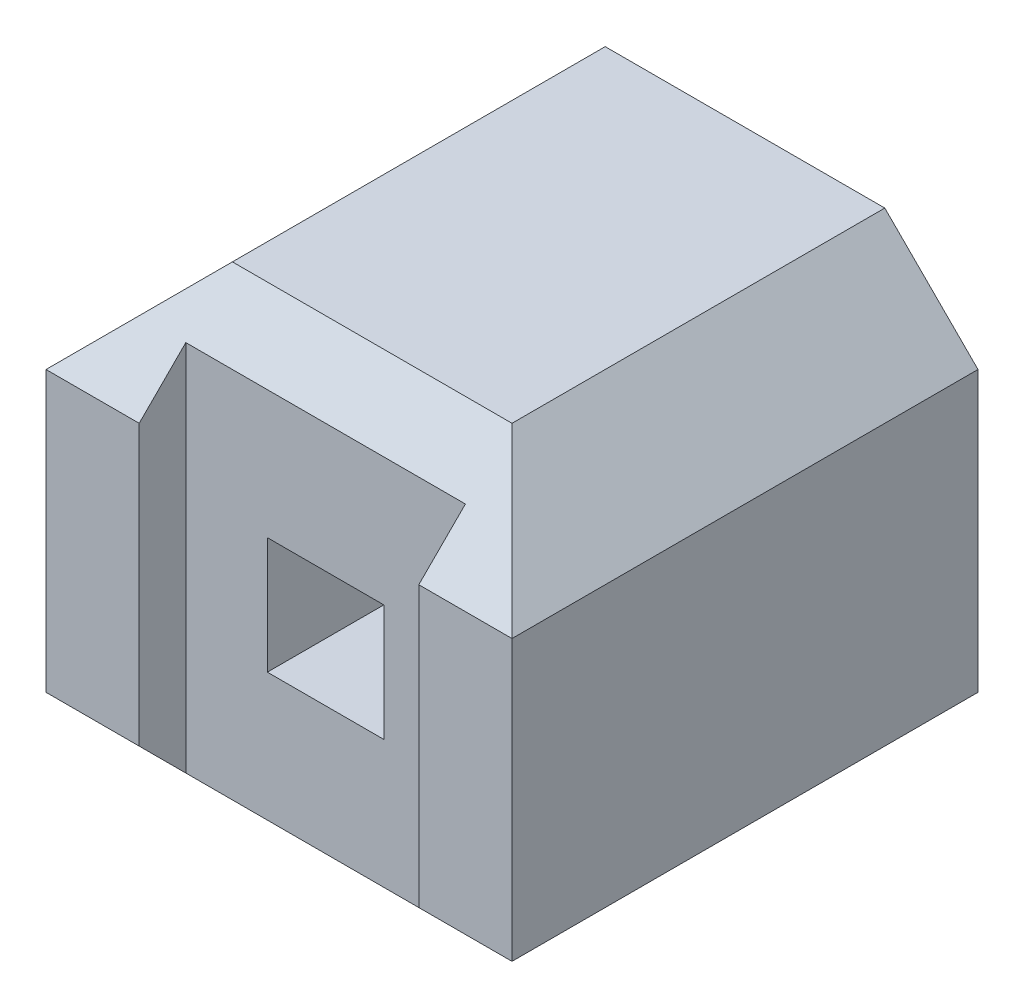
ISO-10303-21;
HEADER;
FILE_DESCRIPTION(('STEP AP214'),'2;1');
FILE_NAME('part.step','',(''),(''),'','','');
FILE_SCHEMA(('AUTOMOTIVE_DESIGN { 1 0 10303 214 1 1 1 1 }'));
ENDSEC;
DATA;
#1=APPLICATION_CONTEXT('core data for automotive mechanical design processes');
#2=APPLICATION_PROTOCOL_DEFINITION('international standard','automotive_design',2000,#1);
#3=PRODUCT_CONTEXT('',#1,'mechanical');
#4=PRODUCT('Part','Part','',(#3));
#5=PRODUCT_RELATED_PRODUCT_CATEGORY('part','',(#4));
#6=PRODUCT_DEFINITION_FORMATION('','',#4);
#7=PRODUCT_DEFINITION_CONTEXT('part definition',#1,'design');
#8=PRODUCT_DEFINITION('design','',#6,#7);
#9=PRODUCT_DEFINITION_SHAPE('','',#8);
#10=(LENGTH_UNIT() NAMED_UNIT(*) SI_UNIT(.MILLI.,.METRE.));
#11=(NAMED_UNIT(*) PLANE_ANGLE_UNIT() SI_UNIT($,.RADIAN.));
#12=(NAMED_UNIT(*) SI_UNIT($,.STERADIAN.) SOLID_ANGLE_UNIT());
#13=UNCERTAINTY_MEASURE_WITH_UNIT(LENGTH_MEASURE(1.E-05),#10,'distance_accuracy_value','');
#14=(GEOMETRIC_REPRESENTATION_CONTEXT(3) GLOBAL_UNCERTAINTY_ASSIGNED_CONTEXT((#13)) GLOBAL_UNIT_ASSIGNED_CONTEXT((#10,
#11,#12)) REPRESENTATION_CONTEXT('',''));
#15=CARTESIAN_POINT('',(0.,0.,0.));
#16=DIRECTION('',(0.,0.,1.));
#17=DIRECTION('',(1.,0.,0.));
#18=AXIS2_PLACEMENT_3D('',#15,#16,#17);
#19=CARTESIAN_POINT('',(1.27,1.27,2.54));
#20=DIRECTION('',(-1.,0.,0.));
#21=DIRECTION('',(0.,0.,1.));
#22=AXIS2_PLACEMENT_3D('',#19,#20,#21);
#23=PLANE('',#22);
#24=DIRECTION('',(0.,0.,1.));
#25=VECTOR('',#24,1.);
#26=CARTESIAN_POINT('',(1.27,3.302,2.54));
#27=LINE('',#26,#25);
#28=CARTESIAN_POINT('',(1.27,3.302,0.));
#29=VERTEX_POINT('',#28);
#30=CARTESIAN_POINT('',(1.27,3.302,2.54));
#31=VERTEX_POINT('',#30);
#32=EDGE_CURVE('E158',#29,#31,#27,.T.);
#33=ORIENTED_EDGE('',*,*,#32,.T.);
#34=DIRECTION('',(0.,1.,0.));
#35=VECTOR('',#34,1.);
#36=CARTESIAN_POINT('',(1.27,0.,2.54));
#37=LINE('',#36,#35);
#38=CARTESIAN_POINT('',(1.27,1.778,2.54));
#39=VERTEX_POINT('',#38);
#40=EDGE_CURVE('E127',#39,#31,#37,.T.);
#41=ORIENTED_EDGE('',*,*,#40,.F.);
#42=DIRECTION('',(0.,0.,1.));
#43=VECTOR('',#42,1.);
#44=CARTESIAN_POINT('',(1.27,1.778,2.54));
#45=LINE('',#44,#43);
#46=CARTESIAN_POINT('',(1.27,1.778,0.));
#47=VERTEX_POINT('',#46);
#48=EDGE_CURVE('E151',#39,#47,#45,.F.);
#49=ORIENTED_EDGE('',*,*,#48,.T.);
#50=DIRECTION('',(0.,1.,0.));
#51=VECTOR('',#50,1.);
#52=CARTESIAN_POINT('',(1.27,1.27,0.));
#53=LINE('',#52,#51);
#54=EDGE_CURVE('E19',#29,#47,#53,.F.);
#55=ORIENTED_EDGE('',*,*,#54,.F.);
#56=EDGE_LOOP('',(#33,#41,#49,#55));
#57=FACE_BOUND('',#56,.T.);
#58=ADVANCED_FACE('F16',(#57),#23,.F.);
#59=CARTESIAN_POINT('',(0.,0.,2.54));
#60=DIRECTION('',(0.,0.,1.));
#61=DIRECTION('',(1.,0.,0.));
#62=AXIS2_PLACEMENT_3D('',#59,#60,#61);
#63=PLANE('',#62);
#64=ORIENTED_EDGE('',*,*,#40,.T.);
#65=DIRECTION('',(1.,0.,0.));
#66=VECTOR('',#65,1.);
#67=CARTESIAN_POINT('',(0.,3.302,2.54));
#68=LINE('',#67,#66);
#69=CARTESIAN_POINT('',(0.762,3.302,2.54));
#70=VERTEX_POINT('',#69);
#71=EDGE_CURVE('E155',#31,#70,#68,.F.);
#72=ORIENTED_EDGE('',*,*,#71,.T.);
#73=DIRECTION('',(0.,-1.,0.));
#74=VECTOR('',#73,1.);
#75=CARTESIAN_POINT('',(0.762,3.81,2.54));
#76=LINE('',#75,#74);
#77=CARTESIAN_POINT('',(0.762,1.778,2.54));
#78=VERTEX_POINT('',#77);
#79=EDGE_CURVE('E134',#78,#70,#76,.F.);
#80=ORIENTED_EDGE('',*,*,#79,.F.);
#81=DIRECTION('',(1.,0.,0.));
#82=VECTOR('',#81,1.);
#83=CARTESIAN_POINT('',(0.,1.778,2.54));
#84=LINE('',#83,#82);
#85=EDGE_CURVE('E130',#78,#39,#84,.T.);
#86=ORIENTED_EDGE('',*,*,#85,.T.);
#87=EDGE_LOOP('',(#64,#72,#80,#86));
#88=FACE_BOUND('',#87,.T.);
#89=ADVANCED_FACE('F132',(#88),#63,.T.);
#90=CARTESIAN_POINT('',(1.27,1.778,2.54));
#91=DIRECTION('',(-0.707106781186548,0.707106781186547,0.));
#92=DIRECTION('',(-0.707106781186547,-0.707106781186548,0.));
#93=AXIS2_PLACEMENT_3D('',#90,#91,#92);
#94=PLANE('',#93);
#95=ORIENTED_EDGE('',*,*,#48,.F.);
#96=DIRECTION('',(0.577350269189626,0.577350269189625,0.577350269189626));
#97=VECTOR('',#96,1.);
#98=CARTESIAN_POINT('',(0.762,1.27,2.032));
#99=LINE('',#98,#97);
#100=CARTESIAN_POINT('',(0.762,1.27,2.032));
#101=VERTEX_POINT('',#100);
#102=EDGE_CURVE('E138',#101,#39,#99,.T.);
#103=ORIENTED_EDGE('',*,*,#102,.F.);
#104=DIRECTION('',(0.,0.,1.));
#105=VECTOR('',#104,1.);
#106=CARTESIAN_POINT('',(0.762,1.27,2.54));
#107=LINE('',#106,#105);
#108=CARTESIAN_POINT('',(0.762,1.27,0.));
#109=VERTEX_POINT('',#108);
#110=EDGE_CURVE('E182',#101,#109,#107,.F.);
#111=ORIENTED_EDGE('',*,*,#110,.T.);
#112=DIRECTION('',(-0.707106781186547,-0.707106781186548,0.));
#113=VECTOR('',#112,1.);
#114=CARTESIAN_POINT('',(1.27,1.778,0.));
#115=LINE('',#114,#113);
#116=EDGE_CURVE('E153',#47,#109,#115,.T.);
#117=ORIENTED_EDGE('',*,*,#116,.F.);
#118=EDGE_LOOP('',(#95,#103,#111,#117));
#119=FACE_BOUND('',#118,.T.);
#120=ADVANCED_FACE('F152',(#119),#94,.F.);
#121=CARTESIAN_POINT('',(0.762,3.81,2.54));
#122=DIRECTION('',(-0.707106781186547,-0.707106781186548,0.));
#123=DIRECTION('',(0.707106781186548,-0.707106781186547,0.));
#124=AXIS2_PLACEMENT_3D('',#121,#122,#123);
#125=PLANE('',#124);
#126=DIRECTION('',(0.,0.,-1.));
#127=VECTOR('',#126,1.);
#128=CARTESIAN_POINT('',(0.762,3.81,2.54));
#129=LINE('',#128,#127);
#130=CARTESIAN_POINT('',(0.762,3.81,0.));
#131=VERTEX_POINT('',#130);
#132=CARTESIAN_POINT('',(0.762,3.81,2.032));
#133=VERTEX_POINT('',#132);
#134=EDGE_CURVE('E186',#131,#133,#129,.F.);
#135=ORIENTED_EDGE('',*,*,#134,.T.);
#136=DIRECTION('',(-0.577350269189626,0.577350269189626,-0.577350269189626));
#137=VECTOR('',#136,1.);
#138=CARTESIAN_POINT('',(1.27,3.302,2.54));
#139=LINE('',#138,#137);
#140=EDGE_CURVE('E165',#31,#133,#139,.T.);
#141=ORIENTED_EDGE('',*,*,#140,.F.);
#142=ORIENTED_EDGE('',*,*,#32,.F.);
#143=DIRECTION('',(0.707106781186548,-0.707106781186547,0.));
#144=VECTOR('',#143,1.);
#145=CARTESIAN_POINT('',(0.762,3.81,0.));
#146=LINE('',#145,#144);
#147=EDGE_CURVE('E167',#131,#29,#146,.T.);
#148=ORIENTED_EDGE('',*,*,#147,.F.);
#149=EDGE_LOOP('',(#135,#141,#142,#148));
#150=FACE_BOUND('',#149,.T.);
#151=ADVANCED_FACE('F357',(#150),#125,.F.);
#152=CARTESIAN_POINT('',(0.762,3.81,2.286));
#153=DIRECTION('',(-1.,0.,0.));
#154=DIRECTION('',(0.,-1.,0.));
#155=AXIS2_PLACEMENT_3D('',#152,#153,#154);
#156=PLANE('',#155);
#157=ORIENTED_EDGE('',*,*,#79,.T.);
#158=DIRECTION('',(0.,-0.707106781186547,0.707106781186548));
#159=VECTOR('',#158,1.);
#160=CARTESIAN_POINT('',(0.762,3.302,2.54));
#161=LINE('',#160,#159);
#162=CARTESIAN_POINT('',(0.762,3.556,2.286));
#163=VERTEX_POINT('',#162);
#164=EDGE_CURVE('E196',#163,#70,#161,.T.);
#165=ORIENTED_EDGE('',*,*,#164,.F.);
#166=DIRECTION('',(0.,1.,0.));
#167=VECTOR('',#166,1.);
#168=CARTESIAN_POINT('',(0.762,0.,2.286));
#169=LINE('',#168,#167);
#170=CARTESIAN_POINT('',(0.762,1.524,2.286));
#171=VERTEX_POINT('',#170);
#172=EDGE_CURVE('E211',#163,#171,#169,.F.);
#173=ORIENTED_EDGE('',*,*,#172,.T.);
#174=DIRECTION('',(0.,-0.707106781186547,-0.707106781186548));
#175=VECTOR('',#174,1.);
#176=CARTESIAN_POINT('',(0.762,1.778,2.54));
#177=LINE('',#176,#175);
#178=EDGE_CURVE('E146',#78,#171,#177,.T.);
#179=ORIENTED_EDGE('',*,*,#178,.F.);
#180=EDGE_LOOP('',(#157,#165,#173,#179));
#181=FACE_BOUND('',#180,.T.);
#182=ADVANCED_FACE('F292',(#181),#156,.T.);
#183=CARTESIAN_POINT('',(-0.762,1.27,2.286));
#184=DIRECTION('',(1.,0.,0.));
#185=DIRECTION('',(0.,0.,-1.));
#186=AXIS2_PLACEMENT_3D('',#183,#184,#185);
#187=PLANE('',#186);
#188=DIRECTION('',(0.,1.,0.));
#189=VECTOR('',#188,1.);
#190=CARTESIAN_POINT('',(-0.762,0.,2.286));
#191=LINE('',#190,#189);
#192=CARTESIAN_POINT('',(-0.762,1.524,2.286));
#193=VERTEX_POINT('',#192);
#194=CARTESIAN_POINT('',(-0.762,3.556,2.286));
#195=VERTEX_POINT('',#194);
#196=EDGE_CURVE('E217',#193,#195,#191,.T.);
#197=ORIENTED_EDGE('',*,*,#196,.T.);
#198=DIRECTION('',(0.,-0.707106781186547,0.707106781186548));
#199=VECTOR('',#198,1.);
#200=CARTESIAN_POINT('',(-0.762,3.302,2.54));
#201=LINE('',#200,#199);
#202=CARTESIAN_POINT('',(-0.762,3.302,2.54));
#203=VERTEX_POINT('',#202);
#204=EDGE_CURVE('E194',#203,#195,#201,.F.);
#205=ORIENTED_EDGE('',*,*,#204,.F.);
#206=DIRECTION('',(0.,1.,0.));
#207=VECTOR('',#206,1.);
#208=CARTESIAN_POINT('',(-0.762,1.27,2.54));
#209=LINE('',#208,#207);
#210=CARTESIAN_POINT('',(-0.762,1.778,2.54));
#211=VERTEX_POINT('',#210);
#212=EDGE_CURVE('E171',#203,#211,#209,.F.);
#213=ORIENTED_EDGE('',*,*,#212,.T.);
#214=DIRECTION('',(0.,-0.707106781186547,-0.707106781186548));
#215=VECTOR('',#214,1.);
#216=CARTESIAN_POINT('',(-0.762,1.778,2.54));
#217=LINE('',#216,#215);
#218=EDGE_CURVE('E176',#193,#211,#217,.F.);
#219=ORIENTED_EDGE('',*,*,#218,.F.);
#220=EDGE_LOOP('',(#197,#205,#213,#219));
#221=FACE_BOUND('',#220,.T.);
#222=ADVANCED_FACE('F283',(#221),#187,.T.);
#223=CARTESIAN_POINT('',(0.3175,2.2225,2.794));
#224=DIRECTION('',(0.,-1.,0.));
#225=DIRECTION('',(0.,0.,-1.));
#226=AXIS2_PLACEMENT_3D('',#223,#224,#225);
#227=PLANE('',#226);
#228=DIRECTION('',(-1.,0.,0.));
#229=VECTOR('',#228,1.);
#230=CARTESIAN_POINT('',(0.,2.2225,2.286));
#231=LINE('',#230,#229);
#232=CARTESIAN_POINT('',(-0.3175,2.2225,2.286));
#233=VERTEX_POINT('',#232);
#234=CARTESIAN_POINT('',(0.3175,2.2225,2.286));
#235=VERTEX_POINT('',#234);
#236=EDGE_CURVE('E209',#233,#235,#231,.F.);
#237=ORIENTED_EDGE('',*,*,#236,.T.);
#238=DIRECTION('',(0.,0.,-1.));
#239=VECTOR('',#238,1.);
#240=CARTESIAN_POINT('',(0.3175,2.2225,2.794));
#241=LINE('',#240,#239);
#242=CARTESIAN_POINT('',(0.3175,2.2225,0.));
#243=VERTEX_POINT('',#242);
#244=EDGE_CURVE('E228',#235,#243,#241,.T.);
#245=ORIENTED_EDGE('',*,*,#244,.T.);
#246=DIRECTION('',(1.,0.,0.));
#247=VECTOR('',#246,1.);
#248=CARTESIAN_POINT('',(0.3175,2.2225,0.));
#249=LINE('',#248,#247);
#250=CARTESIAN_POINT('',(-0.3175,2.2225,0.));
#251=VERTEX_POINT('',#250);
#252=EDGE_CURVE('E173',#251,#243,#249,.T.);
#253=ORIENTED_EDGE('',*,*,#252,.F.);
#254=DIRECTION('',(0.,0.,1.));
#255=VECTOR('',#254,1.);
#256=CARTESIAN_POINT('',(-0.3175,2.2225,2.794));
#257=LINE('',#256,#255);
#258=EDGE_CURVE('E204',#251,#233,#257,.T.);
#259=ORIENTED_EDGE('',*,*,#258,.T.);
#260=EDGE_LOOP('',(#237,#245,#253,#259));
#261=FACE_BOUND('',#260,.T.);
#262=ADVANCED_FACE('F281',(#261),#227,.F.);
#263=CARTESIAN_POINT('',(0.,1.778,2.54));
#264=DIRECTION('',(0.,-0.707106781186548,0.707106781186547));
#265=DIRECTION('',(0.,-0.707106781186547,-0.707106781186548));
#266=AXIS2_PLACEMENT_3D('',#263,#264,#265);
#267=PLANE('',#266);
#268=ORIENTED_EDGE('',*,*,#85,.F.);
#269=ORIENTED_EDGE('',*,*,#178,.T.);
#270=DIRECTION('',(-1.,0.,0.));
#271=VECTOR('',#270,1.);
#272=CARTESIAN_POINT('',(0.,1.524,2.286));
#273=LINE('',#272,#271);
#274=EDGE_CURVE('E214',#171,#193,#273,.T.);
#275=ORIENTED_EDGE('',*,*,#274,.T.);
#276=ORIENTED_EDGE('',*,*,#218,.T.);
#277=DIRECTION('',(1.,0.,0.));
#278=VECTOR('',#277,1.);
#279=CARTESIAN_POINT('',(0.,1.778,2.54));
#280=LINE('',#279,#278);
#281=CARTESIAN_POINT('',(-1.27,1.778,2.54));
#282=VERTEX_POINT('',#281);
#283=EDGE_CURVE('E147',#211,#282,#280,.F.);
#284=ORIENTED_EDGE('',*,*,#283,.T.);
#285=DIRECTION('',(0.577350269189625,-0.577350269189626,-0.577350269189626));
#286=VECTOR('',#285,1.);
#287=CARTESIAN_POINT('',(-1.27,1.778,2.54));
#288=LINE('',#287,#286);
#289=CARTESIAN_POINT('',(-0.762,1.27,2.032));
#290=VERTEX_POINT('',#289);
#291=EDGE_CURVE('E231',#282,#290,#288,.T.);
#292=ORIENTED_EDGE('',*,*,#291,.T.);
#293=DIRECTION('',(1.,0.,0.));
#294=VECTOR('',#293,1.);
#295=CARTESIAN_POINT('',(-1.27,1.27,2.032));
#296=LINE('',#295,#294);
#297=EDGE_CURVE('E142',#290,#101,#296,.T.);
#298=ORIENTED_EDGE('',*,*,#297,.T.);
#299=ORIENTED_EDGE('',*,*,#102,.T.);
#300=EDGE_LOOP('',(#268,#269,#275,#276,#284,#292,#298,#299));
#301=FACE_BOUND('',#300,.T.);
#302=ADVANCED_FACE('F140',(#301),#267,.T.);
#303=CARTESIAN_POINT('',(-1.27,1.27,2.54));
#304=DIRECTION('',(0.,1.,0.));
#305=DIRECTION('',(0.,0.,1.));
#306=AXIS2_PLACEMENT_3D('',#303,#304,#305);
#307=PLANE('',#306);
#308=ORIENTED_EDGE('',*,*,#110,.F.);
#309=ORIENTED_EDGE('',*,*,#297,.F.);
#310=DIRECTION('',(0.,0.,1.));
#311=VECTOR('',#310,1.);
#312=CARTESIAN_POINT('',(-0.762,1.27,2.54));
#313=LINE('',#312,#311);
#314=CARTESIAN_POINT('',(-0.762,1.27,0.));
#315=VERTEX_POINT('',#314);
#316=EDGE_CURVE('E233',#290,#315,#313,.F.);
#317=ORIENTED_EDGE('',*,*,#316,.T.);
#318=DIRECTION('',(1.,0.,0.));
#319=VECTOR('',#318,1.);
#320=CARTESIAN_POINT('',(-1.27,1.27,0.));
#321=LINE('',#320,#319);
#322=EDGE_CURVE('E184',#109,#315,#321,.F.);
#323=ORIENTED_EDGE('',*,*,#322,.F.);
#324=EDGE_LOOP('',(#308,#309,#317,#323));
#325=FACE_BOUND('',#324,.T.);
#326=ADVANCED_FACE('F290',(#325),#307,.F.);
#327=CARTESIAN_POINT('',(1.27,3.81,2.54));
#328=DIRECTION('',(0.,-1.,0.));
#329=DIRECTION('',(0.,0.,-1.));
#330=AXIS2_PLACEMENT_3D('',#327,#328,#329);
#331=PLANE('',#330);
#332=DIRECTION('',(0.,0.,1.));
#333=VECTOR('',#332,1.);
#334=CARTESIAN_POINT('',(-0.762,3.81,2.54));
#335=LINE('',#334,#333);
#336=CARTESIAN_POINT('',(-0.762,3.81,0.));
#337=VERTEX_POINT('',#336);
#338=CARTESIAN_POINT('',(-0.762,3.81,2.032));
#339=VERTEX_POINT('',#338);
#340=EDGE_CURVE('E238',#337,#339,#335,.T.);
#341=ORIENTED_EDGE('',*,*,#340,.T.);
#342=DIRECTION('',(1.,0.,0.));
#343=VECTOR('',#342,1.);
#344=CARTESIAN_POINT('',(0.,3.81,2.032));
#345=LINE('',#344,#343);
#346=EDGE_CURVE('E199',#133,#339,#345,.F.);
#347=ORIENTED_EDGE('',*,*,#346,.F.);
#348=ORIENTED_EDGE('',*,*,#134,.F.);
#349=DIRECTION('',(1.,0.,0.));
#350=VECTOR('',#349,1.);
#351=CARTESIAN_POINT('',(1.27,3.81,0.));
#352=LINE('',#351,#350);
#353=EDGE_CURVE('E189',#337,#131,#352,.T.);
#354=ORIENTED_EDGE('',*,*,#353,.F.);
#355=EDGE_LOOP('',(#341,#347,#348,#354));
#356=FACE_BOUND('',#355,.T.);
#357=ADVANCED_FACE('F328',(#356),#331,.F.);
#358=CARTESIAN_POINT('',(0.,3.302,2.54));
#359=DIRECTION('',(0.,0.707106781186548,0.707106781186547));
#360=DIRECTION('',(0.,-0.707106781186547,0.707106781186548));
#361=AXIS2_PLACEMENT_3D('',#358,#359,#360);
#362=PLANE('',#361);
#363=ORIENTED_EDGE('',*,*,#346,.T.);
#364=DIRECTION('',(-0.577350269189626,-0.577350269189626,0.577350269189626));
#365=VECTOR('',#364,1.);
#366=CARTESIAN_POINT('',(-0.762,3.81,2.032));
#367=LINE('',#366,#365);
#368=CARTESIAN_POINT('',(-1.27,3.302,2.54));
#369=VERTEX_POINT('',#368);
#370=EDGE_CURVE('E241',#339,#369,#367,.T.);
#371=ORIENTED_EDGE('',*,*,#370,.T.);
#372=DIRECTION('',(1.,0.,0.));
#373=VECTOR('',#372,1.);
#374=CARTESIAN_POINT('',(0.,3.302,2.54));
#375=LINE('',#374,#373);
#376=EDGE_CURVE('E192',#369,#203,#375,.T.);
#377=ORIENTED_EDGE('',*,*,#376,.T.);
#378=ORIENTED_EDGE('',*,*,#204,.T.);
#379=DIRECTION('',(-1.,0.,0.));
#380=VECTOR('',#379,1.);
#381=CARTESIAN_POINT('',(0.,3.556,2.286));
#382=LINE('',#381,#380);
#383=EDGE_CURVE('E220',#195,#163,#382,.F.);
#384=ORIENTED_EDGE('',*,*,#383,.T.);
#385=ORIENTED_EDGE('',*,*,#164,.T.);
#386=ORIENTED_EDGE('',*,*,#71,.F.);
#387=ORIENTED_EDGE('',*,*,#140,.T.);
#388=EDGE_LOOP('',(#363,#371,#377,#378,#384,#385,#386,#387));
#389=FACE_BOUND('',#388,.T.);
#390=ADVANCED_FACE('F325',(#389),#362,.T.);
#391=CARTESIAN_POINT('',(-0.3175,2.2225,2.794));
#392=DIRECTION('',(-1.,0.,0.));
#393=DIRECTION('',(0.,0.,1.));
#394=AXIS2_PLACEMENT_3D('',#391,#392,#393);
#395=PLANE('',#394);
#396=DIRECTION('',(0.,1.,0.));
#397=VECTOR('',#396,1.);
#398=CARTESIAN_POINT('',(-0.3175,0.,2.286));
#399=LINE('',#398,#397);
#400=CARTESIAN_POINT('',(-0.3175,2.8575,2.286));
#401=VERTEX_POINT('',#400);
#402=EDGE_CURVE('E206',#401,#233,#399,.F.);
#403=ORIENTED_EDGE('',*,*,#402,.T.);
#404=ORIENTED_EDGE('',*,*,#258,.F.);
#405=DIRECTION('',(0.,1.,0.));
#406=VECTOR('',#405,1.);
#407=CARTESIAN_POINT('',(-0.3175,2.2225,0.));
#408=LINE('',#407,#406);
#409=CARTESIAN_POINT('',(-0.3175,2.8575,0.));
#410=VERTEX_POINT('',#409);
#411=EDGE_CURVE('E201',#410,#251,#408,.F.);
#412=ORIENTED_EDGE('',*,*,#411,.F.);
#413=DIRECTION('',(0.,0.,1.));
#414=VECTOR('',#413,1.);
#415=CARTESIAN_POINT('',(-0.3175,2.8575,2.794));
#416=LINE('',#415,#414);
#417=EDGE_CURVE('E245',#410,#401,#416,.T.);
#418=ORIENTED_EDGE('',*,*,#417,.T.);
#419=EDGE_LOOP('',(#403,#404,#412,#418));
#420=FACE_BOUND('',#419,.T.);
#421=ADVANCED_FACE('F278',(#420),#395,.F.);
#422=CARTESIAN_POINT('',(0.,0.,2.286));
#423=DIRECTION('',(0.,0.,-1.));
#424=DIRECTION('',(-1.,0.,0.));
#425=AXIS2_PLACEMENT_3D('',#422,#423,#424);
#426=PLANE('',#425);
#427=ORIENTED_EDGE('',*,*,#196,.F.);
#428=ORIENTED_EDGE('',*,*,#274,.F.);
#429=ORIENTED_EDGE('',*,*,#172,.F.);
#430=ORIENTED_EDGE('',*,*,#383,.F.);
#431=EDGE_LOOP('',(#427,#428,#429,#430));
#432=FACE_BOUND('',#431,.T.);
#433=ORIENTED_EDGE('',*,*,#402,.F.);
#434=DIRECTION('',(1.,0.,0.));
#435=VECTOR('',#434,1.);
#436=CARTESIAN_POINT('',(-0.3175,2.8575,2.286));
#437=LINE('',#436,#435);
#438=CARTESIAN_POINT('',(0.3175,2.8575,2.286));
#439=VERTEX_POINT('',#438);
#440=EDGE_CURVE('E248',#401,#439,#437,.T.);
#441=ORIENTED_EDGE('',*,*,#440,.T.);
#442=DIRECTION('',(0.,1.,0.));
#443=VECTOR('',#442,1.);
#444=CARTESIAN_POINT('',(0.3175,2.8575,2.286));
#445=LINE('',#444,#443);
#446=EDGE_CURVE('E225',#439,#235,#445,.F.);
#447=ORIENTED_EDGE('',*,*,#446,.T.);
#448=ORIENTED_EDGE('',*,*,#236,.F.);
#449=EDGE_LOOP('',(#433,#441,#447,#448));
#450=FACE_BOUND('',#449,.T.);
#451=ADVANCED_FACE('F276',(#432,#450),#426,.F.);
#452=CARTESIAN_POINT('',(0.3175,2.8575,2.794));
#453=DIRECTION('',(1.,0.,0.));
#454=DIRECTION('',(0.,0.,-1.));
#455=AXIS2_PLACEMENT_3D('',#452,#453,#454);
#456=PLANE('',#455);
#457=ORIENTED_EDGE('',*,*,#446,.F.);
#458=DIRECTION('',(0.,0.,1.));
#459=VECTOR('',#458,1.);
#460=CARTESIAN_POINT('',(0.3175,2.8575,2.794));
#461=LINE('',#460,#459);
#462=CARTESIAN_POINT('',(0.3175,2.8575,0.));
#463=VERTEX_POINT('',#462);
#464=EDGE_CURVE('E251',#439,#463,#461,.F.);
#465=ORIENTED_EDGE('',*,*,#464,.T.);
#466=DIRECTION('',(0.,1.,0.));
#467=VECTOR('',#466,1.);
#468=CARTESIAN_POINT('',(0.3175,2.8575,0.));
#469=LINE('',#468,#467);
#470=EDGE_CURVE('E223',#243,#463,#469,.T.);
#471=ORIENTED_EDGE('',*,*,#470,.F.);
#472=ORIENTED_EDGE('',*,*,#244,.F.);
#473=EDGE_LOOP('',(#457,#465,#471,#472));
#474=FACE_BOUND('',#473,.T.);
#475=ADVANCED_FACE('F273',(#474),#456,.F.);
#476=CARTESIAN_POINT('',(-0.762,1.27,2.54));
#477=DIRECTION('',(0.707106781186548,0.707106781186547,0.));
#478=DIRECTION('',(-0.707106781186547,0.707106781186548,0.));
#479=AXIS2_PLACEMENT_3D('',#476,#477,#478);
#480=PLANE('',#479);
#481=ORIENTED_EDGE('',*,*,#316,.F.);
#482=ORIENTED_EDGE('',*,*,#291,.F.);
#483=DIRECTION('',(0.,0.,-1.));
#484=VECTOR('',#483,1.);
#485=CARTESIAN_POINT('',(-1.27,1.778,2.54));
#486=LINE('',#485,#484);
#487=CARTESIAN_POINT('',(-1.27,1.778,0.));
#488=VERTEX_POINT('',#487);
#489=EDGE_CURVE('E254',#282,#488,#486,.T.);
#490=ORIENTED_EDGE('',*,*,#489,.T.);
#491=DIRECTION('',(-0.707106781186547,0.707106781186548,0.));
#492=VECTOR('',#491,1.);
#493=CARTESIAN_POINT('',(-0.762,1.27,0.));
#494=LINE('',#493,#492);
#495=EDGE_CURVE('E236',#315,#488,#494,.T.);
#496=ORIENTED_EDGE('',*,*,#495,.F.);
#497=EDGE_LOOP('',(#481,#482,#490,#496));
#498=FACE_BOUND('',#497,.T.);
#499=ADVANCED_FACE('F314',(#498),#480,.F.);
#500=CARTESIAN_POINT('',(-1.27,3.302,2.54));
#501=DIRECTION('',(0.707106781186548,-0.707106781186548,0.));
#502=DIRECTION('',(0.707106781186548,0.707106781186548,0.));
#503=AXIS2_PLACEMENT_3D('',#500,#501,#502);
#504=PLANE('',#503);
#505=DIRECTION('',(0.,0.,-1.));
#506=VECTOR('',#505,1.);
#507=CARTESIAN_POINT('',(-1.27,3.302,2.54));
#508=LINE('',#507,#506);
#509=CARTESIAN_POINT('',(-1.27,3.302,0.));
#510=VERTEX_POINT('',#509);
#511=EDGE_CURVE('E257',#510,#369,#508,.F.);
#512=ORIENTED_EDGE('',*,*,#511,.T.);
#513=ORIENTED_EDGE('',*,*,#370,.F.);
#514=ORIENTED_EDGE('',*,*,#340,.F.);
#515=DIRECTION('',(0.707106781186548,0.707106781186548,0.));
#516=VECTOR('',#515,1.);
#517=CARTESIAN_POINT('',(-1.27,3.302,0.));
#518=LINE('',#517,#516);
#519=EDGE_CURVE('E34',#510,#337,#518,.T.);
#520=ORIENTED_EDGE('',*,*,#519,.F.);
#521=EDGE_LOOP('',(#512,#513,#514,#520));
#522=FACE_BOUND('',#521,.T.);
#523=ADVANCED_FACE('F310',(#522),#504,.F.);
#524=CARTESIAN_POINT('',(0.,0.,2.54));
#525=DIRECTION('',(0.,0.,1.));
#526=DIRECTION('',(1.,0.,0.));
#527=AXIS2_PLACEMENT_3D('',#524,#525,#526);
#528=PLANE('',#527);
#529=DIRECTION('',(0.,1.,0.));
#530=VECTOR('',#529,1.);
#531=CARTESIAN_POINT('',(-1.27,3.81,2.54));
#532=LINE('',#531,#530);
#533=EDGE_CURVE('E259',#369,#282,#532,.F.);
#534=ORIENTED_EDGE('',*,*,#533,.T.);
#535=ORIENTED_EDGE('',*,*,#283,.F.);
#536=ORIENTED_EDGE('',*,*,#212,.F.);
#537=ORIENTED_EDGE('',*,*,#376,.F.);
#538=EDGE_LOOP('',(#534,#535,#536,#537));
#539=FACE_BOUND('',#538,.T.);
#540=ADVANCED_FACE('F307',(#539),#528,.T.);
#541=CARTESIAN_POINT('',(-0.3175,2.8575,2.794));
#542=DIRECTION('',(0.,1.,0.));
#543=DIRECTION('',(0.,0.,1.));
#544=AXIS2_PLACEMENT_3D('',#541,#542,#543);
#545=PLANE('',#544);
#546=ORIENTED_EDGE('',*,*,#440,.F.);
#547=ORIENTED_EDGE('',*,*,#417,.F.);
#548=DIRECTION('',(1.,0.,0.));
#549=VECTOR('',#548,1.);
#550=CARTESIAN_POINT('',(0.,2.8575,0.));
#551=LINE('',#550,#549);
#552=EDGE_CURVE('E25',#410,#463,#551,.T.);
#553=ORIENTED_EDGE('',*,*,#552,.T.);
#554=ORIENTED_EDGE('',*,*,#464,.F.);
#555=EDGE_LOOP('',(#546,#547,#553,#554));
#556=FACE_BOUND('',#555,.T.);
#557=ADVANCED_FACE('F268',(#556),#545,.F.);
#558=CARTESIAN_POINT('',(-1.27,3.81,2.54));
#559=DIRECTION('',(1.,0.,0.));
#560=DIRECTION('',(0.,0.,-1.));
#561=AXIS2_PLACEMENT_3D('',#558,#559,#560);
#562=PLANE('',#561);
#563=ORIENTED_EDGE('',*,*,#511,.F.);
#564=DIRECTION('',(0.,1.,0.));
#565=VECTOR('',#564,1.);
#566=CARTESIAN_POINT('',(-1.27,0.,0.));
#567=LINE('',#566,#565);
#568=EDGE_CURVE('E11',#510,#488,#567,.F.);
#569=ORIENTED_EDGE('',*,*,#568,.T.);
#570=ORIENTED_EDGE('',*,*,#489,.F.);
#571=ORIENTED_EDGE('',*,*,#533,.F.);
#572=EDGE_LOOP('',(#563,#569,#570,#571));
#573=FACE_BOUND('',#572,.T.);
#574=ADVANCED_FACE('F296',(#573),#562,.F.);
#575=CARTESIAN_POINT('',(0.,0.,0.));
#576=DIRECTION('',(0.,0.,1.));
#577=DIRECTION('',(1.,0.,0.));
#578=AXIS2_PLACEMENT_3D('',#575,#576,#577);
#579=PLANE('',#578);
#580=ORIENTED_EDGE('',*,*,#519,.T.);
#581=ORIENTED_EDGE('',*,*,#353,.T.);
#582=ORIENTED_EDGE('',*,*,#147,.T.);
#583=ORIENTED_EDGE('',*,*,#54,.T.);
#584=ORIENTED_EDGE('',*,*,#116,.T.);
#585=ORIENTED_EDGE('',*,*,#322,.T.);
#586=ORIENTED_EDGE('',*,*,#495,.T.);
#587=ORIENTED_EDGE('',*,*,#568,.F.);
#588=EDGE_LOOP('',(#580,#581,#582,#583,#584,#585,#586,#587));
#589=FACE_BOUND('',#588,.T.);
#590=ORIENTED_EDGE('',*,*,#411,.T.);
#591=ORIENTED_EDGE('',*,*,#252,.T.);
#592=ORIENTED_EDGE('',*,*,#470,.T.);
#593=ORIENTED_EDGE('',*,*,#552,.F.);
#594=EDGE_LOOP('',(#590,#591,#592,#593));
#595=FACE_BOUND('',#594,.T.);
#596=ADVANCED_FACE('F270',(#589,#595),#579,.F.);
#597=CLOSED_SHELL('',(#58,#89,#120,#151,#182,#222,#262,#302,#326,#357,#390,#421,#451,#475,#499,
#523,#540,#557,#574,#596));
#598=MANIFOLD_SOLID_BREP('B1',#597);
#599=ADVANCED_BREP_SHAPE_REPRESENTATION('',(#18,#598),#14);
#600=SHAPE_DEFINITION_REPRESENTATION(#9,#599);
ENDSEC;
END-ISO-10303-21;
